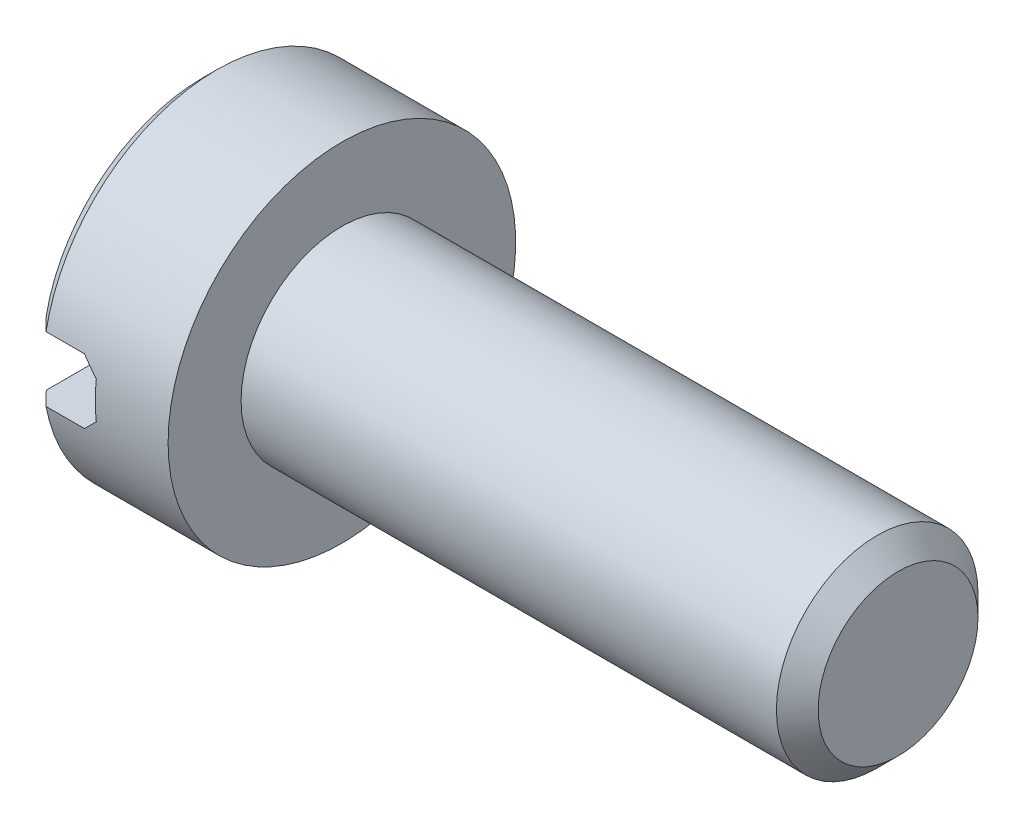
ISO-10303-21;
HEADER;
FILE_DESCRIPTION(('STEP AP214'),'2;1');
FILE_NAME('part.step','',(''),(''),'','','');
FILE_SCHEMA(('AUTOMOTIVE_DESIGN { 1 0 10303 214 1 1 1 1 }'));
ENDSEC;
DATA;
#1=APPLICATION_CONTEXT('core data for automotive mechanical design processes');
#2=APPLICATION_PROTOCOL_DEFINITION('international standard','automotive_design',2000,#1);
#3=PRODUCT_CONTEXT('',#1,'mechanical');
#4=PRODUCT('Part','Part','',(#3));
#5=PRODUCT_RELATED_PRODUCT_CATEGORY('part','',(#4));
#6=PRODUCT_DEFINITION_FORMATION('','',#4);
#7=PRODUCT_DEFINITION_CONTEXT('part definition',#1,'design');
#8=PRODUCT_DEFINITION('design','',#6,#7);
#9=PRODUCT_DEFINITION_SHAPE('','',#8);
#10=(LENGTH_UNIT() NAMED_UNIT(*) SI_UNIT(.MILLI.,.METRE.));
#11=(NAMED_UNIT(*) PLANE_ANGLE_UNIT() SI_UNIT($,.RADIAN.));
#12=(NAMED_UNIT(*) SI_UNIT($,.STERADIAN.) SOLID_ANGLE_UNIT());
#13=UNCERTAINTY_MEASURE_WITH_UNIT(LENGTH_MEASURE(1.E-05),#10,'distance_accuracy_value','');
#14=(GEOMETRIC_REPRESENTATION_CONTEXT(3) GLOBAL_UNCERTAINTY_ASSIGNED_CONTEXT((#13)) GLOBAL_UNIT_ASSIGNED_CONTEXT((#10,
#11,#12)) REPRESENTATION_CONTEXT('',''));
#15=CARTESIAN_POINT('',(0.,0.,0.));
#16=DIRECTION('',(0.,0.,1.));
#17=DIRECTION('',(1.,0.,0.));
#18=AXIS2_PLACEMENT_3D('',#15,#16,#17);
#19=CARTESIAN_POINT('',(2.,2.5,0.));
#20=DIRECTION('',(-1.,0.,0.));
#21=DIRECTION('',(0.,0.,1.));
#22=AXIS2_PLACEMENT_3D('',#19,#20,#21);
#23=PLANE('',#22);
#24=CARTESIAN_POINT('',(2.,0.,0.));
#25=DIRECTION('',(-1.,0.,0.));
#26=DIRECTION('',(0.,0.,1.));
#27=AXIS2_PLACEMENT_3D('',#24,#25,#26);
#28=CIRCLE('',#27,2.5);
#29=CARTESIAN_POINT('',(2.,0.,2.5));
#30=VERTEX_POINT('',#29);
#31=EDGE_CURVE('E189',#30,#30,#28,.T.);
#32=ORIENTED_EDGE('',*,*,#31,.F.);
#33=EDGE_LOOP('',(#32));
#34=FACE_BOUND('',#33,.T.);
#35=CARTESIAN_POINT('',(2.,0.,0.));
#36=DIRECTION('',(-1.,0.,0.));
#37=DIRECTION('',(0.,0.,1.));
#38=AXIS2_PLACEMENT_3D('',#35,#36,#37);
#39=CIRCLE('',#38,1.45);
#40=CARTESIAN_POINT('',(2.,0.,1.45));
#41=VERTEX_POINT('',#40);
#42=EDGE_CURVE('E138',#41,#41,#39,.F.);
#43=ORIENTED_EDGE('',*,*,#42,.F.);
#44=EDGE_LOOP('',(#43));
#45=FACE_BOUND('',#44,.T.);
#46=ADVANCED_FACE('F26',(#34,#45),#23,.F.);
#47=CARTESIAN_POINT('',(0.,0.,0.));
#48=DIRECTION('',(1.,0.,0.));
#49=DIRECTION('',(0.,0.,-1.));
#50=AXIS2_PLACEMENT_3D('',#47,#48,#49);
#51=PLANE('',#50);
#52=CARTESIAN_POINT('',(0.,0.,0.));
#53=DIRECTION('',(-1.,0.,0.));
#54=DIRECTION('',(0.,0.,1.));
#55=AXIS2_PLACEMENT_3D('',#52,#53,#54);
#56=CIRCLE('',#55,2.3);
#57=CARTESIAN_POINT('',(0.,0.465549348230913,2.25239068644003));
#58=VERTEX_POINT('',#57);
#59=CARTESIAN_POINT('',(0.,0.465549348230913,-2.25239068644003));
#60=VERTEX_POINT('',#59);
#61=EDGE_CURVE('E108',#58,#60,#56,.T.);
#62=ORIENTED_EDGE('',*,*,#61,.T.);
#63=DIRECTION('',(0.,0.,1.));
#64=VECTOR('',#63,1.);
#65=CARTESIAN_POINT('',(0.,0.465549348230913,-5.));
#66=LINE('',#65,#64);
#67=EDGE_CURVE('E101',#60,#58,#66,.T.);
#68=ORIENTED_EDGE('',*,*,#67,.T.);
#69=EDGE_LOOP('',(#62,#68));
#70=FACE_BOUND('',#69,.T.);
#71=ADVANCED_FACE('F156',(#70),#51,.F.);
#72=CARTESIAN_POINT('',(0.2,0.,0.));
#73=DIRECTION('',(1.,0.,0.));
#74=DIRECTION('',(0.,0.,-1.));
#75=AXIS2_PLACEMENT_3D('',#72,#73,#74);
#76=CONICAL_SURFACE('',#75,2.5,0.785398163397449);
#77=CARTESIAN_POINT('',(0.2,0.,0.));
#78=DIRECTION('',(-1.,0.,0.));
#79=DIRECTION('',(0.,0.,1.));
#80=AXIS2_PLACEMENT_3D('',#77,#78,#79);
#81=CIRCLE('',#80,2.5);
#82=CARTESIAN_POINT('',(0.2,0.465549348230913,2.45627030360296));
#83=VERTEX_POINT('',#82);
#84=CARTESIAN_POINT('',(0.2,0.465549348230913,-2.45627030360296));
#85=VERTEX_POINT('',#84);
#86=EDGE_CURVE('E109',#83,#85,#81,.T.);
#87=ORIENTED_EDGE('',*,*,#86,.T.);
#88=CARTESIAN_POINT('',(3.20259904076723,0.465549348230913,-5.48286968729098));
#89=CARTESIAN_POINT('',(3.00738145959935,0.465549348230913,-5.28694329289562));
#90=CARTESIAN_POINT('',(2.81219546067579,0.465549348230913,-5.09098538985915));
#91=CARTESIAN_POINT('',(2.42191937891038,0.465549348230913,-4.69895178557872));
#92=CARTESIAN_POINT('',(2.22682930219255,0.465549348230913,-4.50287607823863));
#93=CARTESIAN_POINT('',(1.83653240706012,0.465549348230913,-4.11030517611593));
#94=CARTESIAN_POINT('',(1.64132579611623,0.465549348230913,-3.9138097750014));
#95=CARTESIAN_POINT('',(1.25115924421648,0.465549348230913,-3.52059587027371));
#96=CARTESIAN_POINT('',(1.05619929014715,0.465549348230913,-3.32387737967476));
#97=CARTESIAN_POINT('',(0.678173026290478,0.465549348230913,-2.9416895419363));
#98=CARTESIAN_POINT('',(0.495084501131994,0.465549348230913,-2.7562421918476));
#99=CARTESIAN_POINT('',(0.220902938364085,0.465549348230913,-2.47759625217052));
#100=CARTESIAN_POINT('',(0.129576630819242,0.465549348230913,-2.38462728539378));
#101=CARTESIAN_POINT('',(-0.0528521527638664,0.465549348230913,-2.19847287291091));
#102=CARTESIAN_POINT('',(-0.143954632395984,0.465549348230913,-2.10528743072794));
#103=CARTESIAN_POINT('',(-0.325762187411694,0.465549348230913,-1.91867757427864));
#104=CARTESIAN_POINT('',(-0.416467526691369,0.465549348230913,-1.82525341749482));
#105=CARTESIAN_POINT('',(-0.597381873326261,0.465549348230913,-1.63791440165395));
#106=CARTESIAN_POINT('',(-0.687590849458516,0.465549348230913,-1.54399951243647));
#107=CARTESIAN_POINT('',(-0.867162247825724,0.465549348230913,-1.3554114454591));
#108=CARTESIAN_POINT('',(-0.956524909350582,0.465549348230913,-1.26073849690962));
#109=CARTESIAN_POINT('',(-1.08939468495382,0.465549348230913,-1.11764625640034));
#110=CARTESIAN_POINT('',(-1.1334867082123,0.465549348230913,-1.06977082072954));
#111=CARTESIAN_POINT('',(-1.2210969597667,0.465549348230913,-0.973498550024909));
#112=CARTESIAN_POINT('',(-1.26461520900373,0.465549348230913,-0.925101734137766));
#113=CARTESIAN_POINT('',(-1.3317610681347,0.465549348230913,-0.849065289158111));
#114=CARTESIAN_POINT('',(-1.35569012099074,0.465549348230913,-0.821692131835998));
#115=CARTESIAN_POINT('',(-1.40319102244514,0.465549348230913,-0.766632100193609));
#116=CARTESIAN_POINT('',(-1.42676283514449,0.465549348230913,-0.73894519482706));
#117=CARTESIAN_POINT('',(-1.47366376684455,0.465549348230913,-0.682886365346766));
#118=CARTESIAN_POINT('',(-1.49698800292058,0.465549348230913,-0.654510342179644));
#119=CARTESIAN_POINT('',(-1.54295549742156,0.465549348230913,-0.597221058712914));
#120=CARTESIAN_POINT('',(-1.56559892715386,0.465549348230913,-0.568307936573488));
#121=CARTESIAN_POINT('',(-1.61016736197608,0.465549348230913,-0.509419742712258));
#122=CARTESIAN_POINT('',(-1.63208156923063,0.465549348230913,-0.479436434264725));
#123=CARTESIAN_POINT('',(-1.67445976083722,0.465549348230913,-0.418389024408675));
#124=CARTESIAN_POINT('',(-1.69492180209863,0.465549348230913,-0.387323554832705));
#125=CARTESIAN_POINT('',(-1.73332185678116,0.465549348230913,-0.324061124181559));
#126=CARTESIAN_POINT('',(-1.75128287953761,0.465549348230913,-0.291878431816847));
#127=CARTESIAN_POINT('',(-1.78342369621955,0.465549348230913,-0.225717265309184));
#128=CARTESIAN_POINT('',(-1.79761500076547,0.465549348230913,-0.191744646392133));
#129=CARTESIAN_POINT('',(-1.81895609795713,0.465549348230913,-0.124795883091766));
#130=CARTESIAN_POINT('',(-1.8266128932659,0.465549348230913,-0.0919921322132611));
#131=CARTESIAN_POINT('',(-1.83488894775632,0.465549348230913,-0.0256267496241762));
#132=CARTESIAN_POINT('',(-1.83554895937427,0.465549348230913,0.00792935132869227));
#133=CARTESIAN_POINT('',(-1.82973306120756,0.465549348230913,0.0742464015597508));
#134=CARTESIAN_POINT('',(-1.82328333400206,0.465549348230913,0.107009817283791));
#135=CARTESIAN_POINT('',(-1.80956338762447,0.465549348230913,0.155027331571199));
#136=CARTESIAN_POINT('',(-1.80428518983903,0.465549348230913,0.170909212358321));
#137=CARTESIAN_POINT('',(-1.79261948745361,0.465549348230913,0.202260246274237));
#138=CARTESIAN_POINT('',(-1.78623214101843,0.465549348230913,0.217729457887391));
#139=CARTESIAN_POINT('',(-1.76761840023324,0.465549348230913,0.259328209218331));
#140=CARTESIAN_POINT('',(-1.7545143196465,0.465549348230913,0.285061417842786));
#141=CARTESIAN_POINT('',(-1.72651469614149,0.465549348230913,0.335544158020592));
#142=CARTESIAN_POINT('',(-1.71161720540743,0.465549348230913,0.360292580485516));
#143=CARTESIAN_POINT('',(-1.68054228203642,0.465549348230913,0.409079841714359));
#144=CARTESIAN_POINT('',(-1.66436078635795,0.465549348230913,0.433116068257987));
#145=CARTESIAN_POINT('',(-1.63111775750428,0.465549348230913,0.480575042863358));
#146=CARTESIAN_POINT('',(-1.61405601084805,0.465549348230913,0.503997640009445));
#147=CARTESIAN_POINT('',(-1.5616167270468,0.465549348230913,0.573971640763827));
#148=CARTESIAN_POINT('',(-1.52527399334495,0.465549348230913,0.619796593427046));
#149=CARTESIAN_POINT('',(-1.45124163289229,0.465549348230913,0.710149565111901));
#150=CARTESIAN_POINT('',(-1.41355526157427,0.465549348230913,0.7546802997551));
#151=CARTESIAN_POINT('',(-1.33810033893443,0.465549348230913,0.842013934301668));
#152=CARTESIAN_POINT('',(-1.30035092246978,0.465549348230913,0.884833404050981));
#153=CARTESIAN_POINT('',(-1.22427339982634,0.465549348230913,0.969954837541984));
#154=CARTESIAN_POINT('',(-1.18594527816913,0.465549348230913,1.01225678738678));
#155=CARTESIAN_POINT('',(-1.07035214447441,0.465549348230913,1.13862723555416));
#156=CARTESIAN_POINT('',(-0.992489260170284,0.465549348230913,1.22214795765609));
#157=CARTESIAN_POINT('',(-0.835814007667518,0.465549348230913,1.38847609582379));
#158=CARTESIAN_POINT('',(-0.757000620957103,0.465549348230913,1.47128254610905));
#159=CARTESIAN_POINT('',(-0.598849232799755,0.465549348230913,1.63637982121664));
#160=CARTESIAN_POINT('',(-0.519511274422271,0.465549348230913,1.71867068731607));
#161=CARTESIAN_POINT('',(-0.361217712976167,0.465549348230913,1.88216701603883));
#162=CARTESIAN_POINT('',(-0.282265248575711,0.465549348230913,1.9633755225318));
#163=CARTESIAN_POINT('',(-0.124123333736655,0.465549348230913,2.12556467511988));
#164=CARTESIAN_POINT('',(-0.044933878372658,0.465549348230913,2.20654531641042));
#165=CARTESIAN_POINT('',(0.192811054539122,0.465549348230913,2.44916767308598));
#166=CARTESIAN_POINT('',(0.351615992082501,0.465549348230913,2.61056482504039));
#167=CARTESIAN_POINT('',(0.732972757071635,0.465549348230913,2.99726131212903));
#168=CARTESIAN_POINT('',(0.955700706319338,0.465549348230913,3.22238674752163));
#169=CARTESIAN_POINT('',(1.401572977937,0.465549348230913,3.67230050679293));
#170=CARTESIAN_POINT('',(1.62471736464727,0.465549348230913,3.89708876686418));
#171=CARTESIAN_POINT('',(2.07358635321307,0.465549348230913,4.34881324556589));
#172=CARTESIAN_POINT('',(2.29931333445495,0.465549348230913,4.57574709913376));
#173=CARTESIAN_POINT('',(2.7508805263624,0.465549348230913,5.02942321622607));
#174=CARTESIAN_POINT('',(2.97672071035442,0.465549348230913,5.2561655062971));
#175=CARTESIAN_POINT('',(3.20259904076724,0.465549348230913,5.48286968729098));
#176=B_SPLINE_CURVE_WITH_KNOTS('',3,(#88,#89,#90,#91,#92,#93,#94,#95,#96,#97,#98,#99,#100,#101,
#102,#103,#104,#105,#106,#107,#108,#109,#110,#111,#112,#113,#114,#115,#116,#117,#118,#119,#120,
#121,#122,#123,#124,#125,#126,#127,#128,#129,#130,#131,#132,#133,#134,#135,#136,#137,#138,#139,
#140,#141,#142,#143,#144,#145,#146,#147,#148,#149,#150,#151,#152,#153,#154,#155,#156,#157,#158,
#159,#160,#161,#162,#163,#164,#165,#166,#167,#168,#169,#170,#171,#172,#173,#174,#175),
.UNSPECIFIED.,.F.,.F.,(4,2,2,2,2,2,2,2,2,2,2,2,2,2,2,2,2,2,2,2,2,2,2,2,2,2,2,2,2,2,2,2,2,2,2,2,
2,2,2,2,2,2,2,4),(0.,0.829743073340608,1.65953360095567,2.49046340540357,3.3213470024816,
4.10314469139847,4.49410926633512,4.88506752224857,5.27570632324448,5.66636942212084,
6.05691855181897,6.25217337755999,6.44742105722462,6.55649218217525,6.66557419594665,
6.77576205404667,6.88592195014922,6.99730763492697,7.10883965543405,7.21926609048524,
7.32935136450646,7.42981570469559,7.52969457133972,7.62920684560584,7.67938417859199,
7.72955436214783,7.81607261219315,7.90268569183183,7.9895847021618,8.07650488747965,
8.25190336684877,8.42690244879081,8.59814445390702,8.76939104731505,9.11193368974146,
9.45488345933612,9.79780541262763,10.1375912828317,10.4773842645597,11.1566564623285,
12.1067097788694,13.0569245869456,14.0171665517813,14.9772407465216),.UNSPECIFIED.);
#177=EDGE_CURVE('E49',#85,#60,#176,.T.);
#178=ORIENTED_EDGE('',*,*,#177,.T.);
#179=ORIENTED_EDGE('',*,*,#61,.F.);
#180=EDGE_CURVE('E183',#58,#83,#176,.T.);
#181=ORIENTED_EDGE('',*,*,#180,.T.);
#182=EDGE_LOOP('',(#87,#178,#179,#181));
#183=FACE_BOUND('',#182,.T.);
#184=ADVANCED_FACE('F164',(#183),#76,.T.);
#185=CARTESIAN_POINT('',(0.,-0.465549348230913,-2.25239068644003));
#186=VERTEX_POINT('',#185);
#187=CARTESIAN_POINT('',(0.,-0.465549348230913,2.25239068644003));
#188=VERTEX_POINT('',#187);
#189=EDGE_CURVE('E105',#186,#188,#56,.T.);
#190=ORIENTED_EDGE('',*,*,#189,.T.);
#191=DIRECTION('',(0.,0.,1.));
#192=VECTOR('',#191,1.);
#193=CARTESIAN_POINT('',(0.,-0.465549348230913,-5.));
#194=LINE('',#193,#192);
#195=EDGE_CURVE('E92',#186,#188,#194,.T.);
#196=ORIENTED_EDGE('',*,*,#195,.F.);
#197=EDGE_LOOP('',(#190,#196));
#198=FACE_BOUND('',#197,.T.);
#199=ADVANCED_FACE('F28',(#198),#51,.F.);
#200=CARTESIAN_POINT('',(0.2,-0.465549348230913,-2.45627030360296));
#201=VERTEX_POINT('',#200);
#202=CARTESIAN_POINT('',(0.2,-0.465549348230913,2.45627030360296));
#203=VERTEX_POINT('',#202);
#204=EDGE_CURVE('E113',#201,#203,#81,.T.);
#205=ORIENTED_EDGE('',*,*,#204,.T.);
#206=CARTESIAN_POINT('',(3.20259904076724,-0.465549348230913,5.48286968729098));
#207=CARTESIAN_POINT('',(3.00738145959935,-0.465549348230913,5.28694329289562));
#208=CARTESIAN_POINT('',(2.81219546067579,-0.465549348230913,5.09098538985916));
#209=CARTESIAN_POINT('',(2.42191937891038,-0.465549348230913,4.69895178557872));
#210=CARTESIAN_POINT('',(2.22682930219255,-0.465549348230913,4.50287607823863));
#211=CARTESIAN_POINT('',(1.83653240706012,-0.465549348230913,4.11030517611593));
#212=CARTESIAN_POINT('',(1.64132579611623,-0.465549348230913,3.9138097750014));
#213=CARTESIAN_POINT('',(1.25115924421648,-0.465549348230913,3.52059587027371));
#214=CARTESIAN_POINT('',(1.05619929014715,-0.465549348230913,3.32387737967475));
#215=CARTESIAN_POINT('',(0.678173026290476,-0.465549348230913,2.9416895419363));
#216=CARTESIAN_POINT('',(0.495084501131992,-0.465549348230913,2.75624219184759));
#217=CARTESIAN_POINT('',(0.220902938364083,-0.465549348230913,2.47759625217052));
#218=CARTESIAN_POINT('',(0.12957663081924,-0.465549348230913,2.38462728539378));
#219=CARTESIAN_POINT('',(-0.0528521527638681,-0.465549348230913,2.19847287291091));
#220=CARTESIAN_POINT('',(-0.143954632395986,-0.465549348230913,2.10528743072794));
#221=CARTESIAN_POINT('',(-0.325762187411696,-0.465549348230913,1.91867757427864));
#222=CARTESIAN_POINT('',(-0.41646752669137,-0.465549348230913,1.82525341749482));
#223=CARTESIAN_POINT('',(-0.597381873326262,-0.465549348230913,1.63791440165395));
#224=CARTESIAN_POINT('',(-0.687590849458517,-0.465549348230913,1.54399951243647));
#225=CARTESIAN_POINT('',(-0.867162247825725,-0.465549348230913,1.3554114454591));
#226=CARTESIAN_POINT('',(-0.956524909350583,-0.465549348230913,1.26073849690962));
#227=CARTESIAN_POINT('',(-1.08939468495382,-0.465549348230913,1.11764625640034));
#228=CARTESIAN_POINT('',(-1.1334867082123,-0.465549348230913,1.06977082072953));
#229=CARTESIAN_POINT('',(-1.2210969597667,-0.465549348230913,0.973498550024909));
#230=CARTESIAN_POINT('',(-1.26461520900373,-0.465549348230913,0.925101734137766));
#231=CARTESIAN_POINT('',(-1.33176106813471,-0.465549348230913,0.84906528915811));
#232=CARTESIAN_POINT('',(-1.35569012099074,-0.465549348230913,0.821692131835997));
#233=CARTESIAN_POINT('',(-1.40319102244514,-0.465549348230913,0.766632100193609));
#234=CARTESIAN_POINT('',(-1.42676283514449,-0.465549348230913,0.738945194827059));
#235=CARTESIAN_POINT('',(-1.47366376684455,-0.465549348230913,0.682886365346765));
#236=CARTESIAN_POINT('',(-1.49698800292058,-0.465549348230913,0.654510342179643));
#237=CARTESIAN_POINT('',(-1.54295549742156,-0.465549348230913,0.597221058712913));
#238=CARTESIAN_POINT('',(-1.56559892715386,-0.465549348230913,0.568307936573487));
#239=CARTESIAN_POINT('',(-1.61016736197608,-0.465549348230913,0.509419742712257));
#240=CARTESIAN_POINT('',(-1.63208156923063,-0.465549348230913,0.479436434264725));
#241=CARTESIAN_POINT('',(-1.67445976083722,-0.465549348230913,0.418389024408674));
#242=CARTESIAN_POINT('',(-1.69492180209863,-0.465549348230913,0.387323554832704));
#243=CARTESIAN_POINT('',(-1.73332185678116,-0.465549348230913,0.324061124181558));
#244=CARTESIAN_POINT('',(-1.75128287953761,-0.465549348230913,0.291878431816847));
#245=CARTESIAN_POINT('',(-1.78342369621955,-0.465549348230913,0.225717265309183));
#246=CARTESIAN_POINT('',(-1.79761500076547,-0.465549348230913,0.191744646392132));
#247=CARTESIAN_POINT('',(-1.81895609795713,-0.465549348230913,0.124795883091765));
#248=CARTESIAN_POINT('',(-1.8266128932659,-0.465549348230913,0.0919921322132606));
#249=CARTESIAN_POINT('',(-1.83488894775632,-0.465549348230913,0.0256267496241758));
#250=CARTESIAN_POINT('',(-1.83554895937427,-0.465549348230913,-0.00792935132869264));
#251=CARTESIAN_POINT('',(-1.82973306120756,-0.465549348230913,-0.0742464015597512));
#252=CARTESIAN_POINT('',(-1.82328333400206,-0.465549348230913,-0.107009817283792));
#253=CARTESIAN_POINT('',(-1.80956338762447,-0.465549348230913,-0.155027331571199));
#254=CARTESIAN_POINT('',(-1.80428518983903,-0.465549348230913,-0.170909212358322));
#255=CARTESIAN_POINT('',(-1.79261948745361,-0.465549348230913,-0.202260246274238));
#256=CARTESIAN_POINT('',(-1.78623214101843,-0.465549348230913,-0.217729457887391));
#257=CARTESIAN_POINT('',(-1.76761840023324,-0.465549348230913,-0.259328209218332));
#258=CARTESIAN_POINT('',(-1.7545143196465,-0.465549348230913,-0.285061417842787));
#259=CARTESIAN_POINT('',(-1.72651469614149,-0.465549348230913,-0.335544158020594));
#260=CARTESIAN_POINT('',(-1.71161720540743,-0.465549348230913,-0.360292580485518));
#261=CARTESIAN_POINT('',(-1.68054228203642,-0.465549348230913,-0.40907984171436));
#262=CARTESIAN_POINT('',(-1.66436078635794,-0.465549348230913,-0.433116068257989));
#263=CARTESIAN_POINT('',(-1.63111775750427,-0.465549348230913,-0.48057504286336));
#264=CARTESIAN_POINT('',(-1.61405601084805,-0.465549348230913,-0.503997640009447));
#265=CARTESIAN_POINT('',(-1.5616167270468,-0.465549348230913,-0.573971640763828));
#266=CARTESIAN_POINT('',(-1.52527399334495,-0.465549348230913,-0.619796593427047));
#267=CARTESIAN_POINT('',(-1.45124163289228,-0.465549348230913,-0.710149565111902));
#268=CARTESIAN_POINT('',(-1.41355526157427,-0.465549348230913,-0.754680299755101));
#269=CARTESIAN_POINT('',(-1.33810033893443,-0.465549348230913,-0.842013934301668));
#270=CARTESIAN_POINT('',(-1.30035092246978,-0.465549348230913,-0.88483340405098));
#271=CARTESIAN_POINT('',(-1.22427339982634,-0.465549348230913,-0.969954837541984));
#272=CARTESIAN_POINT('',(-1.18594527816912,-0.465549348230913,-1.01225678738678));
#273=CARTESIAN_POINT('',(-1.07035214447441,-0.465549348230913,-1.13862723555416));
#274=CARTESIAN_POINT('',(-0.992489260170283,-0.465549348230913,-1.2221479576561));
#275=CARTESIAN_POINT('',(-0.835814007667517,-0.465549348230913,-1.38847609582379));
#276=CARTESIAN_POINT('',(-0.757000620957102,-0.465549348230913,-1.47128254610905));
#277=CARTESIAN_POINT('',(-0.598849232799754,-0.465549348230913,-1.63637982121664));
#278=CARTESIAN_POINT('',(-0.51951127442227,-0.465549348230913,-1.71867068731607));
#279=CARTESIAN_POINT('',(-0.361217712976166,-0.465549348230913,-1.88216701603883));
#280=CARTESIAN_POINT('',(-0.282265248575709,-0.465549348230913,-1.9633755225318));
#281=CARTESIAN_POINT('',(-0.124123333736654,-0.465549348230913,-2.12556467511988));
#282=CARTESIAN_POINT('',(-0.0449338783726567,-0.465549348230913,-2.20654531641042));
#283=CARTESIAN_POINT('',(0.192811054539124,-0.465549348230913,-2.44916767308598));
#284=CARTESIAN_POINT('',(0.351615992082503,-0.465549348230913,-2.6105648250404));
#285=CARTESIAN_POINT('',(0.732972757071637,-0.465549348230913,-2.99726131212903));
#286=CARTESIAN_POINT('',(0.95570070631934,-0.465549348230913,-3.22238674752163));
#287=CARTESIAN_POINT('',(1.401572977937,-0.465549348230913,-3.67230050679293));
#288=CARTESIAN_POINT('',(1.62471736464727,-0.465549348230913,-3.89708876686418));
#289=CARTESIAN_POINT('',(2.07358635321307,-0.465549348230913,-4.34881324556589));
#290=CARTESIAN_POINT('',(2.29931333445495,-0.465549348230913,-4.57574709913376));
#291=CARTESIAN_POINT('',(2.75088052636241,-0.465549348230913,-5.02942321622608));
#292=CARTESIAN_POINT('',(2.97672071035443,-0.465549348230913,-5.2561655062971));
#293=CARTESIAN_POINT('',(3.20259904076724,-0.465549348230913,-5.48286968729098));
#294=B_SPLINE_CURVE_WITH_KNOTS('',3,(#206,#207,#208,#209,#210,#211,#212,#213,#214,#215,#216,
#217,#218,#219,#220,#221,#222,#223,#224,#225,#226,#227,#228,#229,#230,#231,#232,#233,#234,#235,
#236,#237,#238,#239,#240,#241,#242,#243,#244,#245,#246,#247,#248,#249,#250,#251,#252,#253,#254,
#255,#256,#257,#258,#259,#260,#261,#262,#263,#264,#265,#266,#267,#268,#269,#270,#271,#272,#273,
#274,#275,#276,#277,#278,#279,#280,#281,#282,#283,#284,#285,#286,#287,#288,#289,#290,#291,#292,
#293),.UNSPECIFIED.,.F.,.F.,(4,2,2,2,2,2,2,2,2,2,2,2,2,2,2,2,2,2,2,2,2,2,2,2,2,2,2,2,2,2,2,2,2,
2,2,2,2,2,2,2,2,2,2,4),(0.,0.82974307334061,1.65953360095567,2.49046340540358,3.32134700248161,
4.10314469139847,4.49410926633512,4.88506752224858,5.27570632324449,5.66636942212084,
6.05691855181898,6.25217337756,6.44742105722463,6.55649218217526,6.66557419594665,
6.77576205404667,6.88592195014922,6.99730763492697,7.10883965543406,7.21926609048525,
7.32935136450647,7.42981570469559,7.52969457133973,7.62920684560584,7.67938417859199,
7.72955436214784,7.81607261219315,7.90268569183183,7.98958470216181,8.07650488747966,
8.25190336684877,8.42690244879082,8.59814445390702,8.76939104731506,9.11193368974146,
9.45488345933612,9.79780541262763,10.1375912828317,10.4773842645597,11.1566564623285,
12.1067097788694,13.0569245869456,14.0171665517813,14.9772407465216),.UNSPECIFIED.);
#295=EDGE_CURVE('E100',#203,#188,#294,.T.);
#296=ORIENTED_EDGE('',*,*,#295,.T.);
#297=ORIENTED_EDGE('',*,*,#189,.F.);
#298=EDGE_CURVE('E89',#186,#201,#294,.T.);
#299=ORIENTED_EDGE('',*,*,#298,.T.);
#300=EDGE_LOOP('',(#205,#296,#297,#299));
#301=FACE_BOUND('',#300,.T.);
#302=ADVANCED_FACE('F107',(#301),#76,.T.);
#303=CARTESIAN_POINT('',(0.,0.,0.));
#304=DIRECTION('',(-1.,0.,0.));
#305=DIRECTION('',(0.,0.,1.));
#306=AXIS2_PLACEMENT_3D('',#303,#304,#305);
#307=CYLINDRICAL_SURFACE('',#306,2.5);
#308=ORIENTED_EDGE('',*,*,#86,.F.);
#309=DIRECTION('',(-1.,0.,0.));
#310=VECTOR('',#309,1.);
#311=CARTESIAN_POINT('',(0.,0.465549348230913,2.45627030360296));
#312=LINE('',#311,#310);
#313=CARTESIAN_POINT('',(0.753445065176908,0.465549348230913,2.45627030360296));
#314=VERTEX_POINT('',#313);
#315=EDGE_CURVE('E135',#83,#314,#312,.F.);
#316=ORIENTED_EDGE('',*,*,#315,.T.);
#317=CARTESIAN_POINT('',(1.21899441340782,0.,0.));
#318=DIRECTION('',(0.707106781186548,0.707106781186548,0.));
#319=DIRECTION('',(-0.707106781186548,0.707106781186548,0.));
#320=AXIS2_PLACEMENT_3D('',#317,#318,#319);
#321=ELLIPSE('',#320,3.53553390593274,2.5);
#322=CARTESIAN_POINT('',(0.953445065176908,0.265549348230913,2.48585670215605));
#323=VERTEX_POINT('',#322);
#324=EDGE_CURVE('E130',#314,#323,#321,.T.);
#325=ORIENTED_EDGE('',*,*,#324,.T.);
#326=CARTESIAN_POINT('',(0.953445065176908,0.,0.));
#327=DIRECTION('',(1.,0.,0.));
#328=DIRECTION('',(0.,0.,-1.));
#329=AXIS2_PLACEMENT_3D('',#326,#327,#328);
#330=CIRCLE('',#329,2.5);
#331=CARTESIAN_POINT('',(0.953445065176908,-0.265549348230913,2.48585670215605));
#332=VERTEX_POINT('',#331);
#333=EDGE_CURVE('E126',#323,#332,#330,.T.);
#334=ORIENTED_EDGE('',*,*,#333,.T.);
#335=CARTESIAN_POINT('',(1.21899441340782,0.,0.));
#336=DIRECTION('',(0.707106781186548,-0.707106781186548,0.));
#337=DIRECTION('',(-0.707106781186548,-0.707106781186548,0.));
#338=AXIS2_PLACEMENT_3D('',#335,#336,#337);
#339=ELLIPSE('',#338,3.53553390593274,2.5);
#340=CARTESIAN_POINT('',(0.753445065176908,-0.465549348230913,2.45627030360296));
#341=VERTEX_POINT('',#340);
#342=EDGE_CURVE('E122',#332,#341,#339,.T.);
#343=ORIENTED_EDGE('',*,*,#342,.T.);
#344=DIRECTION('',(-1.,0.,0.));
#345=VECTOR('',#344,1.);
#346=CARTESIAN_POINT('',(0.,-0.465549348230913,2.45627030360296));
#347=LINE('',#346,#345);
#348=EDGE_CURVE('E132',#341,#203,#347,.T.);
#349=ORIENTED_EDGE('',*,*,#348,.T.);
#350=ORIENTED_EDGE('',*,*,#204,.F.);
#351=DIRECTION('',(-1.,0.,0.));
#352=VECTOR('',#351,1.);
#353=CARTESIAN_POINT('',(0.,-0.465549348230913,-2.45627030360296));
#354=LINE('',#353,#352);
#355=CARTESIAN_POINT('',(0.753445065176908,-0.465549348230913,-2.45627030360296));
#356=VERTEX_POINT('',#355);
#357=EDGE_CURVE('E95',#201,#356,#354,.F.);
#358=ORIENTED_EDGE('',*,*,#357,.T.);
#359=CARTESIAN_POINT('',(0.953445065176908,-0.265549348230913,-2.48585670215605));
#360=VERTEX_POINT('',#359);
#361=EDGE_CURVE('E118',#356,#360,#339,.T.);
#362=ORIENTED_EDGE('',*,*,#361,.T.);
#363=CARTESIAN_POINT('',(0.953445065176908,0.265549348230913,-2.48585670215605));
#364=VERTEX_POINT('',#363);
#365=EDGE_CURVE('E121',#360,#364,#330,.T.);
#366=ORIENTED_EDGE('',*,*,#365,.T.);
#367=CARTESIAN_POINT('',(0.753445065176908,0.465549348230913,-2.45627030360296));
#368=VERTEX_POINT('',#367);
#369=EDGE_CURVE('E125',#364,#368,#321,.T.);
#370=ORIENTED_EDGE('',*,*,#369,.T.);
#371=DIRECTION('',(-1.,0.,0.));
#372=VECTOR('',#371,1.);
#373=CARTESIAN_POINT('',(0.,0.465549348230913,-2.45627030360296));
#374=LINE('',#373,#372);
#375=EDGE_CURVE('E129',#368,#85,#374,.T.);
#376=ORIENTED_EDGE('',*,*,#375,.T.);
#377=EDGE_LOOP('',(#308,#316,#325,#334,#343,#349,#350,#358,#362,#366,#370,#376));
#378=FACE_BOUND('',#377,.T.);
#379=ORIENTED_EDGE('',*,*,#31,.T.);
#380=EDGE_LOOP('',(#379));
#381=FACE_BOUND('',#380,.T.);
#382=ADVANCED_FACE('F172',(#378,#381),#307,.T.);
#383=CARTESIAN_POINT('',(0.,0.465549348230913,-5.));
#384=DIRECTION('',(0.,1.,0.));
#385=DIRECTION('',(0.,0.,1.));
#386=AXIS2_PLACEMENT_3D('',#383,#384,#385);
#387=PLANE('',#386);
#388=ORIENTED_EDGE('',*,*,#375,.F.);
#389=DIRECTION('',(0.,0.,1.));
#390=VECTOR('',#389,1.);
#391=CARTESIAN_POINT('',(0.753445065176908,0.465549348230913,-5.));
#392=LINE('',#391,#390);
#393=EDGE_CURVE('E218',#368,#314,#392,.T.);
#394=ORIENTED_EDGE('',*,*,#393,.T.);
#395=ORIENTED_EDGE('',*,*,#315,.F.);
#396=ORIENTED_EDGE('',*,*,#180,.F.);
#397=ORIENTED_EDGE('',*,*,#67,.F.);
#398=ORIENTED_EDGE('',*,*,#177,.F.);
#399=EDGE_LOOP('',(#388,#394,#395,#396,#397,#398));
#400=FACE_BOUND('',#399,.T.);
#401=ADVANCED_FACE('F174',(#400),#387,.F.);
#402=CARTESIAN_POINT('',(0.753445065176908,0.465549348230913,-5.));
#403=DIRECTION('',(0.707106781186548,0.707106781186548,0.));
#404=DIRECTION('',(-0.707106781186548,0.707106781186548,0.));
#405=AXIS2_PLACEMENT_3D('',#402,#403,#404);
#406=PLANE('',#405);
#407=ORIENTED_EDGE('',*,*,#393,.F.);
#408=ORIENTED_EDGE('',*,*,#369,.F.);
#409=DIRECTION('',(0.,0.,1.));
#410=VECTOR('',#409,1.);
#411=CARTESIAN_POINT('',(0.953445065176908,0.265549348230913,-5.));
#412=LINE('',#411,#410);
#413=EDGE_CURVE('E220',#364,#323,#412,.T.);
#414=ORIENTED_EDGE('',*,*,#413,.T.);
#415=ORIENTED_EDGE('',*,*,#324,.F.);
#416=EDGE_LOOP('',(#407,#408,#414,#415));
#417=FACE_BOUND('',#416,.T.);
#418=ADVANCED_FACE('F194',(#417),#406,.F.);
#419=CARTESIAN_POINT('',(0.953445065176908,0.265549348230913,-5.));
#420=DIRECTION('',(1.,0.,0.));
#421=DIRECTION('',(0.,0.,-1.));
#422=AXIS2_PLACEMENT_3D('',#419,#420,#421);
#423=PLANE('',#422);
#424=ORIENTED_EDGE('',*,*,#413,.F.);
#425=ORIENTED_EDGE('',*,*,#365,.F.);
#426=DIRECTION('',(0.,0.,1.));
#427=VECTOR('',#426,1.);
#428=CARTESIAN_POINT('',(0.953445065176908,-0.265549348230913,-5.));
#429=LINE('',#428,#427);
#430=EDGE_CURVE('E209',#360,#332,#429,.T.);
#431=ORIENTED_EDGE('',*,*,#430,.T.);
#432=ORIENTED_EDGE('',*,*,#333,.F.);
#433=EDGE_LOOP('',(#424,#425,#431,#432));
#434=FACE_BOUND('',#433,.T.);
#435=ADVANCED_FACE('F197',(#434),#423,.F.);
#436=CARTESIAN_POINT('',(0.753445065176908,-0.465549348230913,-5.));
#437=DIRECTION('',(0.707106781186548,-0.707106781186548,0.));
#438=DIRECTION('',(0.707106781186548,0.707106781186548,0.));
#439=AXIS2_PLACEMENT_3D('',#436,#437,#438);
#440=PLANE('',#439);
#441=DIRECTION('',(0.,0.,1.));
#442=VECTOR('',#441,1.);
#443=CARTESIAN_POINT('',(0.753445065176908,-0.465549348230913,-5.));
#444=LINE('',#443,#442);
#445=EDGE_CURVE('E41',#356,#341,#444,.T.);
#446=ORIENTED_EDGE('',*,*,#445,.T.);
#447=ORIENTED_EDGE('',*,*,#342,.F.);
#448=ORIENTED_EDGE('',*,*,#430,.F.);
#449=ORIENTED_EDGE('',*,*,#361,.F.);
#450=EDGE_LOOP('',(#446,#447,#448,#449));
#451=FACE_BOUND('',#450,.T.);
#452=ADVANCED_FACE('F200',(#451),#440,.F.);
#453=CARTESIAN_POINT('',(0.,-0.465549348230913,-5.));
#454=DIRECTION('',(0.,-1.,0.));
#455=DIRECTION('',(0.,0.,-1.));
#456=AXIS2_PLACEMENT_3D('',#453,#454,#455);
#457=PLANE('',#456);
#458=ORIENTED_EDGE('',*,*,#348,.F.);
#459=ORIENTED_EDGE('',*,*,#445,.F.);
#460=ORIENTED_EDGE('',*,*,#357,.F.);
#461=ORIENTED_EDGE('',*,*,#298,.F.);
#462=ORIENTED_EDGE('',*,*,#195,.T.);
#463=ORIENTED_EDGE('',*,*,#295,.F.);
#464=EDGE_LOOP('',(#458,#459,#460,#461,#462,#463));
#465=FACE_BOUND('',#464,.T.);
#466=ADVANCED_FACE('F91',(#465),#457,.F.);
#467=CARTESIAN_POINT('',(10.,0.,0.));
#468=DIRECTION('',(-1.,0.,0.));
#469=DIRECTION('',(0.,0.,1.));
#470=AXIS2_PLACEMENT_3D('',#467,#468,#469);
#471=CYLINDRICAL_SURFACE('',#470,1.45);
#472=CARTESIAN_POINT('',(9.7,0.,0.));
#473=DIRECTION('',(1.,0.,0.));
#474=DIRECTION('',(0.,0.,-1.));
#475=AXIS2_PLACEMENT_3D('',#472,#473,#474);
#476=CIRCLE('',#475,1.45);
#477=CARTESIAN_POINT('',(9.7,0.,-1.45));
#478=VERTEX_POINT('',#477);
#479=EDGE_CURVE('E11',#478,#478,#476,.F.);
#480=ORIENTED_EDGE('',*,*,#479,.T.);
#481=EDGE_LOOP('',(#480));
#482=FACE_BOUND('',#481,.T.);
#483=ORIENTED_EDGE('',*,*,#42,.T.);
#484=EDGE_LOOP('',(#483));
#485=FACE_BOUND('',#484,.T.);
#486=ADVANCED_FACE('F152',(#482,#485),#471,.T.);
#487=CARTESIAN_POINT('',(10.,0.,0.));
#488=DIRECTION('',(1.,0.,0.));
#489=DIRECTION('',(0.,0.,-1.));
#490=AXIS2_PLACEMENT_3D('',#487,#488,#489);
#491=PLANE('',#490);
#492=CARTESIAN_POINT('',(10.,0.,0.));
#493=DIRECTION('',(1.,0.,0.));
#494=DIRECTION('',(0.,0.,-1.));
#495=AXIS2_PLACEMENT_3D('',#492,#493,#494);
#496=CIRCLE('',#495,1.15);
#497=CARTESIAN_POINT('',(10.,0.,-1.15));
#498=VERTEX_POINT('',#497);
#499=EDGE_CURVE('E34',#498,#498,#496,.T.);
#500=ORIENTED_EDGE('',*,*,#499,.T.);
#501=EDGE_LOOP('',(#500));
#502=FACE_BOUND('',#501,.T.);
#503=ADVANCED_FACE('F143',(#502),#491,.T.);
#504=CARTESIAN_POINT('',(10.,0.,0.));
#505=DIRECTION('',(-1.,0.,0.));
#506=DIRECTION('',(0.,0.,1.));
#507=AXIS2_PLACEMENT_3D('',#504,#505,#506);
#508=CONICAL_SURFACE('',#507,1.15,0.785398163397445);
#509=ORIENTED_EDGE('',*,*,#479,.F.);
#510=EDGE_LOOP('',(#509));
#511=FACE_BOUND('',#510,.T.);
#512=ORIENTED_EDGE('',*,*,#499,.F.);
#513=EDGE_LOOP('',(#512));
#514=FACE_BOUND('',#513,.T.);
#515=ADVANCED_FACE('F145',(#511,#514),#508,.T.);
#516=CLOSED_SHELL('',(#46,#71,#184,#199,#302,#382,#401,#418,#435,#452,#466,#486,#503,#515));
#517=MANIFOLD_SOLID_BREP('B2',#516);
#518=ADVANCED_BREP_SHAPE_REPRESENTATION('',(#18,#517),#14);
#519=SHAPE_DEFINITION_REPRESENTATION(#9,#518);
ENDSEC;
END-ISO-10303-21;
